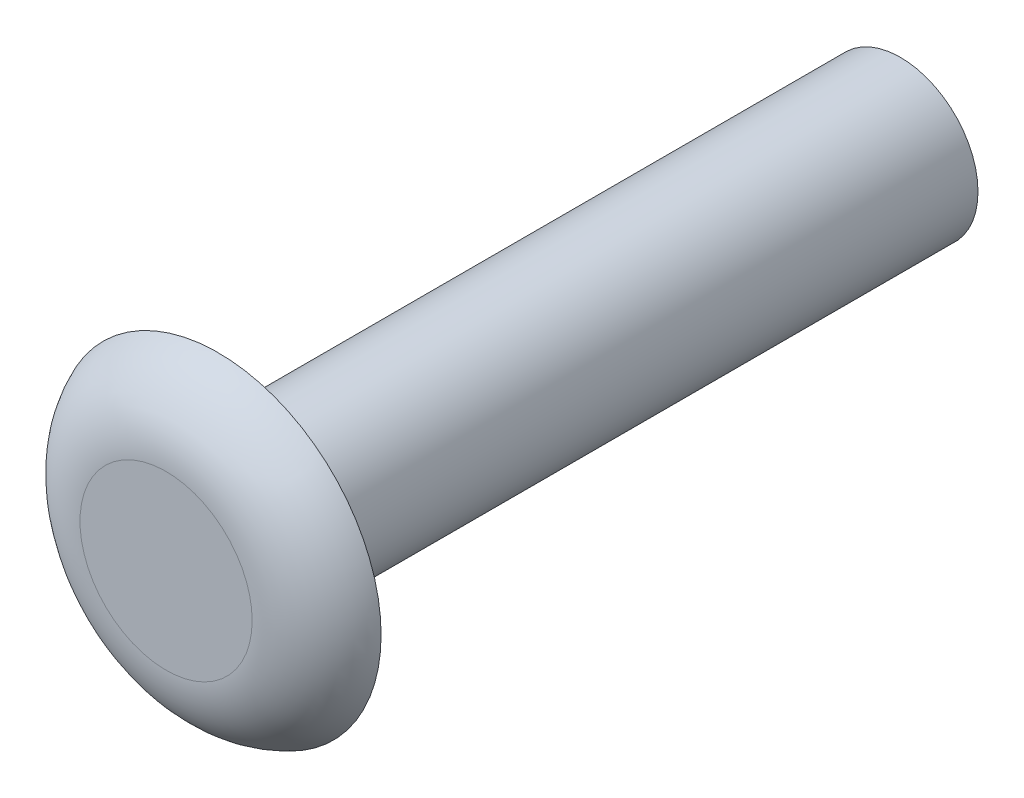
ISO-10303-21;
HEADER;
FILE_DESCRIPTION(('STEP AP214'),'2;1');
FILE_NAME('part.step','',(''),(''),'','','');
FILE_SCHEMA(('AUTOMOTIVE_DESIGN { 1 0 10303 214 1 1 1 1 }'));
ENDSEC;
DATA;
#1=APPLICATION_CONTEXT('core data for automotive mechanical design processes');
#2=APPLICATION_PROTOCOL_DEFINITION('international standard','automotive_design',2000,#1);
#3=PRODUCT_CONTEXT('',#1,'mechanical');
#4=PRODUCT('Part','Part','',(#3));
#5=PRODUCT_RELATED_PRODUCT_CATEGORY('part','',(#4));
#6=PRODUCT_DEFINITION_FORMATION('','',#4);
#7=PRODUCT_DEFINITION_CONTEXT('part definition',#1,'design');
#8=PRODUCT_DEFINITION('design','',#6,#7);
#9=PRODUCT_DEFINITION_SHAPE('','',#8);
#10=(LENGTH_UNIT() NAMED_UNIT(*) SI_UNIT(.MILLI.,.METRE.));
#11=(NAMED_UNIT(*) PLANE_ANGLE_UNIT() SI_UNIT($,.RADIAN.));
#12=(NAMED_UNIT(*) SI_UNIT($,.STERADIAN.) SOLID_ANGLE_UNIT());
#13=UNCERTAINTY_MEASURE_WITH_UNIT(LENGTH_MEASURE(1.E-05),#10,'distance_accuracy_value','');
#14=(GEOMETRIC_REPRESENTATION_CONTEXT(3) GLOBAL_UNCERTAINTY_ASSIGNED_CONTEXT((#13)) GLOBAL_UNIT_ASSIGNED_CONTEXT((#10,
#11,#12)) REPRESENTATION_CONTEXT('',''));
#15=CARTESIAN_POINT('',(0.,0.,0.));
#16=DIRECTION('',(0.,0.,1.));
#17=DIRECTION('',(1.,0.,0.));
#18=AXIS2_PLACEMENT_3D('',#15,#16,#17);
#19=CARTESIAN_POINT('',(0.,0.,1.6002));
#20=DIRECTION('',(0.,0.,1.));
#21=DIRECTION('',(1.,0.,0.));
#22=AXIS2_PLACEMENT_3D('',#19,#20,#21);
#23=PLANE('',#22);
#24=CARTESIAN_POINT('',(0.,0.,1.6002));
#25=DIRECTION('',(0.,0.,1.));
#26=DIRECTION('',(1.,0.,0.));
#27=AXIS2_PLACEMENT_3D('',#24,#25,#26);
#28=CIRCLE('',#27,2.64405934475841);
#29=CARTESIAN_POINT('',(2.64405934475841,0.,1.6002));
#30=VERTEX_POINT('',#29);
#31=EDGE_CURVE('E10',#30,#30,#28,.T.);
#32=ORIENTED_EDGE('',*,*,#31,.T.);
#33=EDGE_LOOP('',(#32));
#34=FACE_BOUND('',#33,.T.);
#35=ADVANCED_FACE('F35',(#34),#23,.T.);
#36=CARTESIAN_POINT('',(0.,0.,0.));
#37=DIRECTION('',(0.,0.,1.));
#38=DIRECTION('',(1.,0.,0.));
#39=AXIS2_PLACEMENT_3D('',#36,#37,#38);
#40=PLANE('',#39);
#41=CARTESIAN_POINT('',(0.,0.,0.));
#42=DIRECTION('',(0.,0.,1.));
#43=DIRECTION('',(1.,0.,0.));
#44=AXIS2_PLACEMENT_3D('',#41,#42,#43);
#45=CIRCLE('',#44,2.38125);
#46=CARTESIAN_POINT('',(2.38125,0.,0.));
#47=VERTEX_POINT('',#46);
#48=EDGE_CURVE('E50',#47,#47,#45,.T.);
#49=ORIENTED_EDGE('',*,*,#48,.T.);
#50=EDGE_LOOP('',(#49));
#51=FACE_BOUND('',#50,.T.);
#52=CARTESIAN_POINT('',(0.,0.,0.));
#53=DIRECTION('',(0.,0.,1.));
#54=DIRECTION('',(1.,0.,0.));
#55=AXIS2_PLACEMENT_3D('',#52,#53,#54);
#56=CIRCLE('',#55,5.0038);
#57=CARTESIAN_POINT('',(5.0038,0.,0.));
#58=VERTEX_POINT('',#57);
#59=EDGE_CURVE('E42',#58,#58,#56,.T.);
#60=ORIENTED_EDGE('',*,*,#59,.F.);
#61=EDGE_LOOP('',(#60));
#62=FACE_BOUND('',#61,.T.);
#63=ADVANCED_FACE('F56',(#51,#62),#40,.F.);
#64=CARTESIAN_POINT('',(0.,0.,-20.955));
#65=DIRECTION('',(0.,0.,1.));
#66=DIRECTION('',(1.,0.,0.));
#67=AXIS2_PLACEMENT_3D('',#64,#65,#66);
#68=CYLINDRICAL_SURFACE('',#67,2.38125);
#69=CARTESIAN_POINT('',(0.,0.,-20.955));
#70=DIRECTION('',(0.,0.,1.));
#71=DIRECTION('',(1.,0.,0.));
#72=AXIS2_PLACEMENT_3D('',#69,#70,#71);
#73=CIRCLE('',#72,2.38125);
#74=CARTESIAN_POINT('',(2.38125,0.,-20.955));
#75=VERTEX_POINT('',#74);
#76=EDGE_CURVE('E46',#75,#75,#73,.T.);
#77=ORIENTED_EDGE('',*,*,#76,.T.);
#78=EDGE_LOOP('',(#77));
#79=FACE_BOUND('',#78,.T.);
#80=ORIENTED_EDGE('',*,*,#48,.F.);
#81=EDGE_LOOP('',(#80));
#82=FACE_BOUND('',#81,.T.);
#83=ADVANCED_FACE('F59',(#79,#82),#68,.T.);
#84=CARTESIAN_POINT('',(0.,0.,-20.955));
#85=DIRECTION('',(0.,0.,1.));
#86=DIRECTION('',(1.,0.,0.));
#87=AXIS2_PLACEMENT_3D('',#84,#85,#86);
#88=PLANE('',#87);
#89=ORIENTED_EDGE('',*,*,#76,.F.);
#90=EDGE_LOOP('',(#89));
#91=FACE_BOUND('',#90,.T.);
#92=ADVANCED_FACE('F61',(#91),#88,.F.);
#93=CARTESIAN_POINT('',(0.,0.,-0.9398));
#94=DIRECTION('',(0.,0.,-1.));
#95=DIRECTION('',(-1.,0.,0.));
#96=AXIS2_PLACEMENT_3D('',#93,#94,#95);
#97=TOROIDAL_SURFACE('',#96,2.64405934475841,2.54);
#98=ORIENTED_EDGE('',*,*,#59,.T.);
#99=EDGE_LOOP('',(#98));
#100=FACE_BOUND('',#99,.T.);
#101=ORIENTED_EDGE('',*,*,#31,.F.);
#102=EDGE_LOOP('',(#101));
#103=FACE_BOUND('',#102,.T.);
#104=ADVANCED_FACE('F37',(#100,#103),#97,.T.);
#105=CLOSED_SHELL('',(#35,#63,#83,#92,#104));
#106=MANIFOLD_SOLID_BREP('B2',#105);
#107=ADVANCED_BREP_SHAPE_REPRESENTATION('',(#18,#106),#14);
#108=SHAPE_DEFINITION_REPRESENTATION(#9,#107);
ENDSEC;
END-ISO-10303-21;
